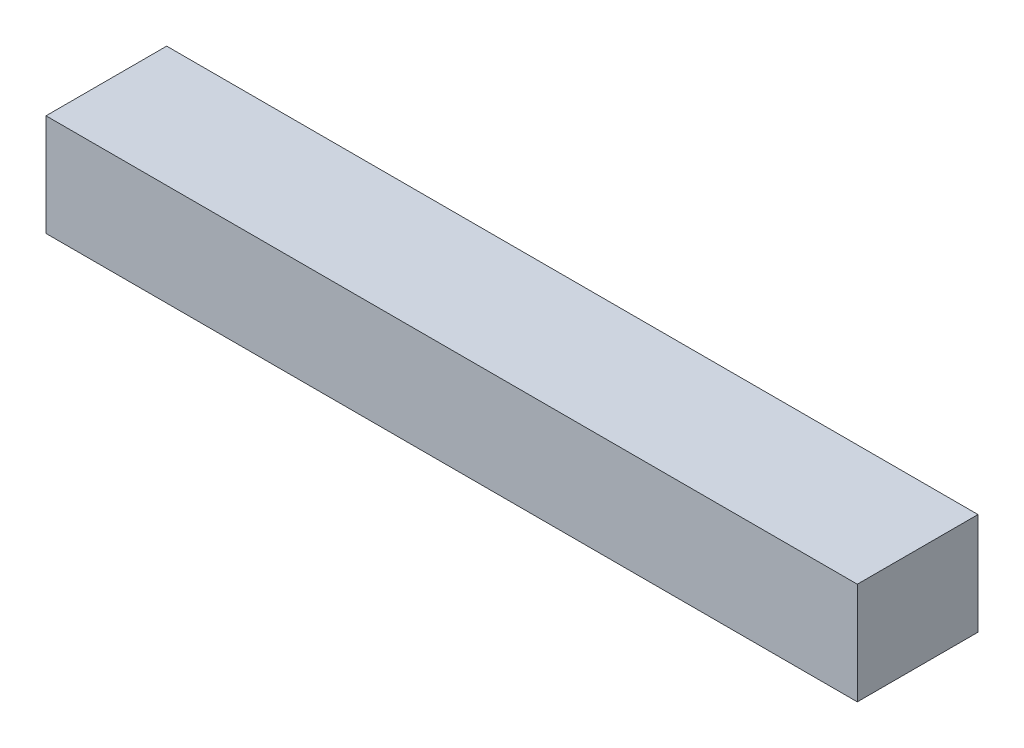
ISO-10303-21;
HEADER;
FILE_DESCRIPTION(('STEP AP214'),'2;1');
FILE_NAME('part.step','',(''),(''),'','','');
FILE_SCHEMA(('AUTOMOTIVE_DESIGN { 1 0 10303 214 1 1 1 1 }'));
ENDSEC;
DATA;
#1=APPLICATION_CONTEXT('core data for automotive mechanical design processes');
#2=APPLICATION_PROTOCOL_DEFINITION('international standard','automotive_design',2000,#1);
#3=PRODUCT_CONTEXT('',#1,'mechanical');
#4=PRODUCT('Part','Part','',(#3));
#5=PRODUCT_RELATED_PRODUCT_CATEGORY('part','',(#4));
#6=PRODUCT_DEFINITION_FORMATION('','',#4);
#7=PRODUCT_DEFINITION_CONTEXT('part definition',#1,'design');
#8=PRODUCT_DEFINITION('design','',#6,#7);
#9=PRODUCT_DEFINITION_SHAPE('','',#8);
#10=(LENGTH_UNIT() NAMED_UNIT(*) SI_UNIT(.MILLI.,.METRE.));
#11=(NAMED_UNIT(*) PLANE_ANGLE_UNIT() SI_UNIT($,.RADIAN.));
#12=(NAMED_UNIT(*) SI_UNIT($,.STERADIAN.) SOLID_ANGLE_UNIT());
#13=UNCERTAINTY_MEASURE_WITH_UNIT(LENGTH_MEASURE(1.E-05),#10,'distance_accuracy_value','');
#14=(GEOMETRIC_REPRESENTATION_CONTEXT(3) GLOBAL_UNCERTAINTY_ASSIGNED_CONTEXT((#13)) GLOBAL_UNIT_ASSIGNED_CONTEXT((#10,
#11,#12)) REPRESENTATION_CONTEXT('',''));
#15=CARTESIAN_POINT('',(0.,0.,0.));
#16=DIRECTION('',(0.,0.,1.));
#17=DIRECTION('',(1.,0.,0.));
#18=AXIS2_PLACEMENT_3D('',#15,#16,#17);
#19=CARTESIAN_POINT('',(-4.97499894,-0.62500002,1.47999958));
#20=DIRECTION('',(0.,0.,-1.));
#21=DIRECTION('',(0.,-1.,0.));
#22=AXIS2_PLACEMENT_3D('',#19,#20,#21);
#23=PLANE('',#22);
#24=DIRECTION('',(1.,0.,0.));
#25=VECTOR('',#24,1.);
#26=CARTESIAN_POINT('',(-4.97499894,-0.62500002,1.47999958));
#27=LINE('',#26,#25);
#28=CARTESIAN_POINT('',(-4.97499894,-0.62500002,1.47999958));
#29=VERTEX_POINT('',#28);
#30=CARTESIAN_POINT('',(4.97499894,-0.62500002,1.47999958));
#31=VERTEX_POINT('',#30);
#32=EDGE_CURVE('E87',#29,#31,#27,.T.);
#33=ORIENTED_EDGE('',*,*,#32,.T.);
#34=DIRECTION('',(0.,1.,0.));
#35=VECTOR('',#34,1.);
#36=CARTESIAN_POINT('',(4.97499894,-0.62500002,1.47999958));
#37=LINE('',#36,#35);
#38=CARTESIAN_POINT('',(4.97499894,0.62500002,1.47999958));
#39=VERTEX_POINT('',#38);
#40=EDGE_CURVE('E105',#31,#39,#37,.T.);
#41=ORIENTED_EDGE('',*,*,#40,.T.);
#42=DIRECTION('',(-1.,0.,0.));
#43=VECTOR('',#42,1.);
#44=CARTESIAN_POINT('',(4.97499894,0.62500002,1.47999958));
#45=LINE('',#44,#43);
#46=CARTESIAN_POINT('',(-4.97499894,0.62500002,1.47999958));
#47=VERTEX_POINT('',#46);
#48=EDGE_CURVE('E80',#39,#47,#45,.T.);
#49=ORIENTED_EDGE('',*,*,#48,.T.);
#50=DIRECTION('',(0.,-1.,0.));
#51=VECTOR('',#50,1.);
#52=CARTESIAN_POINT('',(-4.97499894,0.62500002,1.47999958));
#53=LINE('',#52,#51);
#54=EDGE_CURVE('E11',#47,#29,#53,.T.);
#55=ORIENTED_EDGE('',*,*,#54,.T.);
#56=EDGE_LOOP('',(#33,#41,#49,#55));
#57=FACE_BOUND('',#56,.T.);
#58=ADVANCED_FACE('F17',(#57),#23,.F.);
#59=CARTESIAN_POINT('',(-4.97499894,-0.62500002,0.));
#60=DIRECTION('',(0.,0.,-1.));
#61=DIRECTION('',(0.,-1.,0.));
#62=AXIS2_PLACEMENT_3D('',#59,#60,#61);
#63=PLANE('',#62);
#64=DIRECTION('',(0.,-1.,0.));
#65=VECTOR('',#64,1.);
#66=CARTESIAN_POINT('',(-4.97499894,0.62500002,0.));
#67=LINE('',#66,#65);
#68=CARTESIAN_POINT('',(-4.97499894,0.62500002,0.));
#69=VERTEX_POINT('',#68);
#70=CARTESIAN_POINT('',(-4.97499894,-0.62500002,0.));
#71=VERTEX_POINT('',#70);
#72=EDGE_CURVE('E28',#69,#71,#67,.T.);
#73=ORIENTED_EDGE('',*,*,#72,.F.);
#74=DIRECTION('',(-1.,0.,0.));
#75=VECTOR('',#74,1.);
#76=CARTESIAN_POINT('',(4.97499894,0.62500002,0.));
#77=LINE('',#76,#75);
#78=CARTESIAN_POINT('',(4.97499894,0.62500002,0.));
#79=VERTEX_POINT('',#78);
#80=EDGE_CURVE('E21',#79,#69,#77,.T.);
#81=ORIENTED_EDGE('',*,*,#80,.F.);
#82=DIRECTION('',(0.,1.,0.));
#83=VECTOR('',#82,1.);
#84=CARTESIAN_POINT('',(4.97499894,-0.62500002,0.));
#85=LINE('',#84,#83);
#86=CARTESIAN_POINT('',(4.97499894,-0.62500002,0.));
#87=VERTEX_POINT('',#86);
#88=EDGE_CURVE('E89',#87,#79,#85,.T.);
#89=ORIENTED_EDGE('',*,*,#88,.F.);
#90=DIRECTION('',(1.,0.,0.));
#91=VECTOR('',#90,1.);
#92=CARTESIAN_POINT('',(-4.97499894,-0.62500002,0.));
#93=LINE('',#92,#91);
#94=EDGE_CURVE('E86',#71,#87,#93,.T.);
#95=ORIENTED_EDGE('',*,*,#94,.F.);
#96=EDGE_LOOP('',(#73,#81,#89,#95));
#97=FACE_BOUND('',#96,.T.);
#98=ADVANCED_FACE('F91',(#97),#63,.T.);
#99=CARTESIAN_POINT('',(-4.97499894,0.62500002,0.));
#100=DIRECTION('',(1.,0.,0.));
#101=DIRECTION('',(0.,1.,0.));
#102=AXIS2_PLACEMENT_3D('',#99,#100,#101);
#103=PLANE('',#102);
#104=ORIENTED_EDGE('',*,*,#72,.T.);
#105=DIRECTION('',(0.,0.,1.));
#106=VECTOR('',#105,1.);
#107=CARTESIAN_POINT('',(-4.97499894,-0.62500002,0.));
#108=LINE('',#107,#106);
#109=EDGE_CURVE('E74',#71,#29,#108,.T.);
#110=ORIENTED_EDGE('',*,*,#109,.T.);
#111=ORIENTED_EDGE('',*,*,#54,.F.);
#112=DIRECTION('',(0.,0.,1.));
#113=VECTOR('',#112,1.);
#114=CARTESIAN_POINT('',(-4.97499894,0.62500002,0.));
#115=LINE('',#114,#113);
#116=EDGE_CURVE('E77',#69,#47,#115,.T.);
#117=ORIENTED_EDGE('',*,*,#116,.F.);
#118=EDGE_LOOP('',(#104,#110,#111,#117));
#119=FACE_BOUND('',#118,.T.);
#120=ADVANCED_FACE('F73',(#119),#103,.F.);
#121=CARTESIAN_POINT('',(4.97499894,0.62500002,0.));
#122=DIRECTION('',(0.,-1.,0.));
#123=DIRECTION('',(0.,0.,-1.));
#124=AXIS2_PLACEMENT_3D('',#121,#122,#123);
#125=PLANE('',#124);
#126=ORIENTED_EDGE('',*,*,#80,.T.);
#127=ORIENTED_EDGE('',*,*,#116,.T.);
#128=ORIENTED_EDGE('',*,*,#48,.F.);
#129=DIRECTION('',(0.,0.,1.));
#130=VECTOR('',#129,1.);
#131=CARTESIAN_POINT('',(4.97499894,0.62500002,0.));
#132=LINE('',#131,#130);
#133=EDGE_CURVE('E109',#79,#39,#132,.T.);
#134=ORIENTED_EDGE('',*,*,#133,.F.);
#135=EDGE_LOOP('',(#126,#127,#128,#134));
#136=FACE_BOUND('',#135,.T.);
#137=ADVANCED_FACE('F130',(#136),#125,.F.);
#138=CARTESIAN_POINT('',(4.97499894,-0.62500002,0.));
#139=DIRECTION('',(-1.,0.,0.));
#140=DIRECTION('',(0.,0.,1.));
#141=AXIS2_PLACEMENT_3D('',#138,#139,#140);
#142=PLANE('',#141);
#143=ORIENTED_EDGE('',*,*,#88,.T.);
#144=ORIENTED_EDGE('',*,*,#133,.T.);
#145=ORIENTED_EDGE('',*,*,#40,.F.);
#146=DIRECTION('',(0.,0.,1.));
#147=VECTOR('',#146,1.);
#148=CARTESIAN_POINT('',(4.97499894,-0.62500002,0.));
#149=LINE('',#148,#147);
#150=EDGE_CURVE('E95',#87,#31,#149,.T.);
#151=ORIENTED_EDGE('',*,*,#150,.F.);
#152=EDGE_LOOP('',(#143,#144,#145,#151));
#153=FACE_BOUND('',#152,.T.);
#154=ADVANCED_FACE('F19',(#153),#142,.F.);
#155=CARTESIAN_POINT('',(-4.97499894,-0.62500002,0.));
#156=DIRECTION('',(0.,1.,0.));
#157=DIRECTION('',(1.,0.,0.));
#158=AXIS2_PLACEMENT_3D('',#155,#156,#157);
#159=PLANE('',#158);
#160=ORIENTED_EDGE('',*,*,#94,.T.);
#161=ORIENTED_EDGE('',*,*,#150,.T.);
#162=ORIENTED_EDGE('',*,*,#32,.F.);
#163=ORIENTED_EDGE('',*,*,#109,.F.);
#164=EDGE_LOOP('',(#160,#161,#162,#163));
#165=FACE_BOUND('',#164,.T.);
#166=ADVANCED_FACE('F84',(#165),#159,.F.);
#167=CLOSED_SHELL('',(#58,#98,#120,#137,#154,#166));
#168=MANIFOLD_SOLID_BREP('B1',#167);
#169=ADVANCED_BREP_SHAPE_REPRESENTATION('',(#18,#168),#14);
#170=SHAPE_DEFINITION_REPRESENTATION(#9,#169);
ENDSEC;
END-ISO-10303-21;
